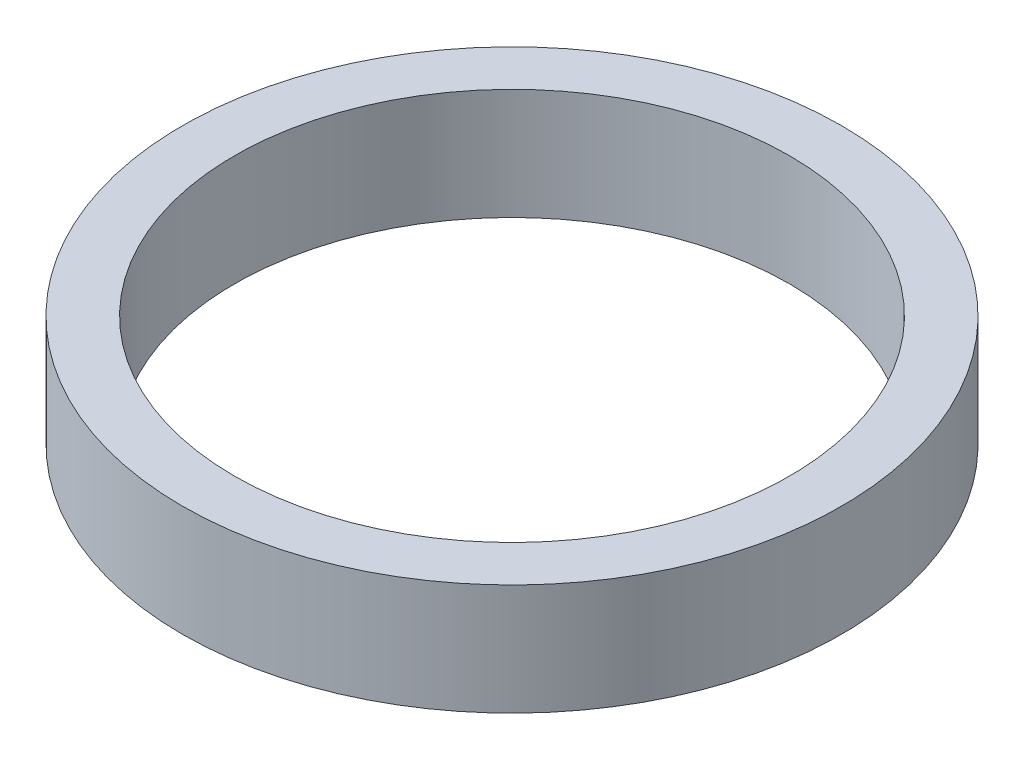
ISO-10303-21;
HEADER;
FILE_DESCRIPTION(('STEP AP214'),'2;1');
FILE_NAME('part.step','',(''),(''),'','','');
FILE_SCHEMA(('AUTOMOTIVE_DESIGN { 1 0 10303 214 1 1 1 1 }'));
ENDSEC;
DATA;
#1=APPLICATION_CONTEXT('core data for automotive mechanical design processes');
#2=APPLICATION_PROTOCOL_DEFINITION('international standard','automotive_design',2000,#1);
#3=PRODUCT_CONTEXT('',#1,'mechanical');
#4=PRODUCT('Part','Part','',(#3));
#5=PRODUCT_RELATED_PRODUCT_CATEGORY('part','',(#4));
#6=PRODUCT_DEFINITION_FORMATION('','',#4);
#7=PRODUCT_DEFINITION_CONTEXT('part definition',#1,'design');
#8=PRODUCT_DEFINITION('design','',#6,#7);
#9=PRODUCT_DEFINITION_SHAPE('','',#8);
#10=(LENGTH_UNIT() NAMED_UNIT(*) SI_UNIT(.MILLI.,.METRE.));
#11=(NAMED_UNIT(*) PLANE_ANGLE_UNIT() SI_UNIT($,.RADIAN.));
#12=(NAMED_UNIT(*) SI_UNIT($,.STERADIAN.) SOLID_ANGLE_UNIT());
#13=UNCERTAINTY_MEASURE_WITH_UNIT(LENGTH_MEASURE(1.E-05),#10,'distance_accuracy_value','');
#14=(GEOMETRIC_REPRESENTATION_CONTEXT(3) GLOBAL_UNCERTAINTY_ASSIGNED_CONTEXT((#13)) GLOBAL_UNIT_ASSIGNED_CONTEXT((#10,
#11,#12)) REPRESENTATION_CONTEXT('',''));
#15=CARTESIAN_POINT('',(0.,0.,0.));
#16=DIRECTION('',(0.,0.,1.));
#17=DIRECTION('',(1.,0.,0.));
#18=AXIS2_PLACEMENT_3D('',#15,#16,#17);
#19=CARTESIAN_POINT('',(0.,16.,0.));
#20=DIRECTION('',(0.,-1.,0.));
#21=DIRECTION('',(0.,0.,-1.));
#22=AXIS2_PLACEMENT_3D('',#19,#20,#21);
#23=CYLINDRICAL_SURFACE('',#22,47.5);
#24=CARTESIAN_POINT('',(0.,16.,0.));
#25=DIRECTION('',(0.,1.,0.));
#26=DIRECTION('',(0.,0.,1.));
#27=AXIS2_PLACEMENT_3D('',#24,#25,#26);
#28=CIRCLE('',#27,47.5);
#29=CARTESIAN_POINT('',(0.,16.,47.5));
#30=VERTEX_POINT('',#29);
#31=EDGE_CURVE('E10',#30,#30,#28,.T.);
#32=ORIENTED_EDGE('',*,*,#31,.F.);
#33=EDGE_LOOP('',(#32));
#34=FACE_BOUND('',#33,.T.);
#35=CARTESIAN_POINT('',(0.,0.,0.));
#36=DIRECTION('',(0.,1.,0.));
#37=DIRECTION('',(0.,0.,1.));
#38=AXIS2_PLACEMENT_3D('',#35,#36,#37);
#39=CIRCLE('',#38,47.5);
#40=CARTESIAN_POINT('',(0.,0.,47.5));
#41=VERTEX_POINT('',#40);
#42=EDGE_CURVE('E37',#41,#41,#39,.T.);
#43=ORIENTED_EDGE('',*,*,#42,.T.);
#44=EDGE_LOOP('',(#43));
#45=FACE_BOUND('',#44,.T.);
#46=ADVANCED_FACE('F40',(#34,#45),#23,.T.);
#47=CARTESIAN_POINT('',(0.,16.,0.));
#48=DIRECTION('',(0.,1.,0.));
#49=DIRECTION('',(0.,0.,1.));
#50=AXIS2_PLACEMENT_3D('',#47,#48,#49);
#51=PLANE('',#50);
#52=CARTESIAN_POINT('',(0.,16.,0.));
#53=DIRECTION('',(0.,1.,0.));
#54=DIRECTION('',(0.,0.,1.));
#55=AXIS2_PLACEMENT_3D('',#52,#53,#54);
#56=CIRCLE('',#55,40.);
#57=CARTESIAN_POINT('',(0.,16.,40.));
#58=VERTEX_POINT('',#57);
#59=EDGE_CURVE('E50',#58,#58,#56,.T.);
#60=ORIENTED_EDGE('',*,*,#59,.F.);
#61=EDGE_LOOP('',(#60));
#62=FACE_BOUND('',#61,.T.);
#63=ORIENTED_EDGE('',*,*,#31,.T.);
#64=EDGE_LOOP('',(#63));
#65=FACE_BOUND('',#64,.T.);
#66=ADVANCED_FACE('F59',(#62,#65),#51,.T.);
#67=CARTESIAN_POINT('',(0.,0.,0.));
#68=DIRECTION('',(0.,1.,0.));
#69=DIRECTION('',(0.,0.,1.));
#70=AXIS2_PLACEMENT_3D('',#67,#68,#69);
#71=PLANE('',#70);
#72=CARTESIAN_POINT('',(0.,0.,0.));
#73=DIRECTION('',(0.,1.,0.));
#74=DIRECTION('',(0.,0.,1.));
#75=AXIS2_PLACEMENT_3D('',#72,#73,#74);
#76=CIRCLE('',#75,40.);
#77=CARTESIAN_POINT('',(0.,0.,40.));
#78=VERTEX_POINT('',#77);
#79=EDGE_CURVE('E47',#78,#78,#76,.T.);
#80=ORIENTED_EDGE('',*,*,#79,.T.);
#81=EDGE_LOOP('',(#80));
#82=FACE_BOUND('',#81,.T.);
#83=ORIENTED_EDGE('',*,*,#42,.F.);
#84=EDGE_LOOP('',(#83));
#85=FACE_BOUND('',#84,.T.);
#86=ADVANCED_FACE('F58',(#82,#85),#71,.F.);
#87=CARTESIAN_POINT('',(0.,16.,0.));
#88=DIRECTION('',(0.,-1.,0.));
#89=DIRECTION('',(0.,0.,-1.));
#90=AXIS2_PLACEMENT_3D('',#87,#88,#89);
#91=CYLINDRICAL_SURFACE('',#90,40.);
#92=ORIENTED_EDGE('',*,*,#59,.T.);
#93=EDGE_LOOP('',(#92));
#94=FACE_BOUND('',#93,.T.);
#95=ORIENTED_EDGE('',*,*,#79,.F.);
#96=EDGE_LOOP('',(#95));
#97=FACE_BOUND('',#96,.T.);
#98=ADVANCED_FACE('F54',(#94,#97),#91,.F.);
#99=CLOSED_SHELL('',(#46,#66,#86,#98));
#100=MANIFOLD_SOLID_BREP('B2',#99);
#101=ADVANCED_BREP_SHAPE_REPRESENTATION('',(#18,#100),#14);
#102=SHAPE_DEFINITION_REPRESENTATION(#9,#101);
ENDSEC;
END-ISO-10303-21;
